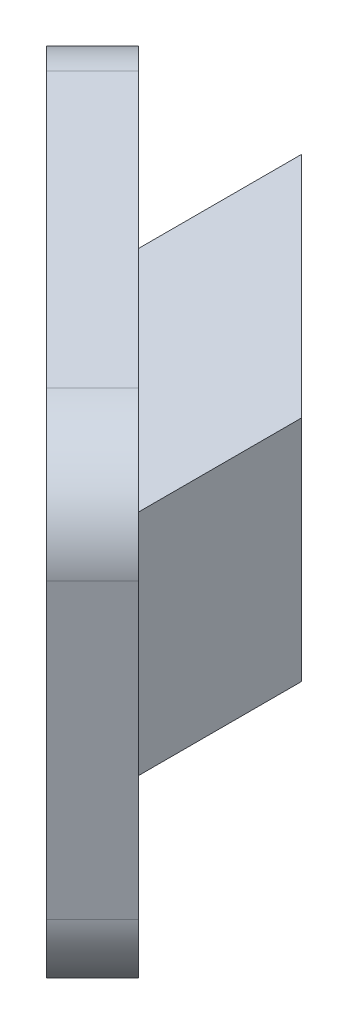
ISO-10303-21;
HEADER;
FILE_DESCRIPTION(('STEP AP214'),'2;1');
FILE_NAME('part.step','',(''),(''),'','','');
FILE_SCHEMA(('AUTOMOTIVE_DESIGN { 1 0 10303 214 1 1 1 1 }'));
ENDSEC;
DATA;
#1=APPLICATION_CONTEXT('core data for automotive mechanical design processes');
#2=APPLICATION_PROTOCOL_DEFINITION('international standard','automotive_design',2000,#1);
#3=PRODUCT_CONTEXT('',#1,'mechanical');
#4=PRODUCT('Part','Part','',(#3));
#5=PRODUCT_RELATED_PRODUCT_CATEGORY('part','',(#4));
#6=PRODUCT_DEFINITION_FORMATION('','',#4);
#7=PRODUCT_DEFINITION_CONTEXT('part definition',#1,'design');
#8=PRODUCT_DEFINITION('design','',#6,#7);
#9=PRODUCT_DEFINITION_SHAPE('','',#8);
#10=(LENGTH_UNIT() NAMED_UNIT(*) SI_UNIT(.MILLI.,.METRE.));
#11=(NAMED_UNIT(*) PLANE_ANGLE_UNIT() SI_UNIT($,.RADIAN.));
#12=(NAMED_UNIT(*) SI_UNIT($,.STERADIAN.) SOLID_ANGLE_UNIT());
#13=UNCERTAINTY_MEASURE_WITH_UNIT(LENGTH_MEASURE(1.E-05),#10,'distance_accuracy_value','');
#14=(GEOMETRIC_REPRESENTATION_CONTEXT(3) GLOBAL_UNCERTAINTY_ASSIGNED_CONTEXT((#13)) GLOBAL_UNIT_ASSIGNED_CONTEXT((#10,
#11,#12)) REPRESENTATION_CONTEXT('',''));
#15=CARTESIAN_POINT('',(0.,0.,0.));
#16=DIRECTION('',(0.,0.,1.));
#17=DIRECTION('',(1.,0.,0.));
#18=AXIS2_PLACEMENT_3D('',#15,#16,#17);
#19=CARTESIAN_POINT('',(3.5,3.5,12.));
#20=DIRECTION('',(-1.,0.,0.));
#21=DIRECTION('',(0.,-1.,0.));
#22=AXIS2_PLACEMENT_3D('',#19,#20,#21);
#23=PLANE('',#22);
#24=DIRECTION('',(0.,0.,-1.));
#25=VECTOR('',#24,1.);
#26=CARTESIAN_POINT('',(3.5,-3.5,12.));
#27=LINE('',#26,#25);
#28=CARTESIAN_POINT('',(3.5,-3.5,12.));
#29=VERTEX_POINT('',#28);
#30=CARTESIAN_POINT('',(3.5,-3.5,7.));
#31=VERTEX_POINT('',#30);
#32=EDGE_CURVE('E164',#29,#31,#27,.T.);
#33=ORIENTED_EDGE('',*,*,#32,.T.);
#34=DIRECTION('',(0.,1.,0.));
#35=VECTOR('',#34,1.);
#36=CARTESIAN_POINT('',(3.5,-7.5,7.));
#37=LINE('',#36,#35);
#38=CARTESIAN_POINT('',(3.5,3.5,7.));
#39=VERTEX_POINT('',#38);
#40=EDGE_CURVE('E153',#31,#39,#37,.T.);
#41=ORIENTED_EDGE('',*,*,#40,.T.);
#42=DIRECTION('',(0.,0.,-1.));
#43=VECTOR('',#42,1.);
#44=CARTESIAN_POINT('',(3.5,3.5,12.));
#45=LINE('',#44,#43);
#46=CARTESIAN_POINT('',(3.5,3.5,12.));
#47=VERTEX_POINT('',#46);
#48=EDGE_CURVE('E151',#47,#39,#45,.T.);
#49=ORIENTED_EDGE('',*,*,#48,.F.);
#50=DIRECTION('',(0.,1.,0.));
#51=VECTOR('',#50,1.);
#52=CARTESIAN_POINT('',(3.5,3.5,12.));
#53=LINE('',#52,#51);
#54=EDGE_CURVE('E141',#29,#47,#53,.T.);
#55=ORIENTED_EDGE('',*,*,#54,.F.);
#56=EDGE_LOOP('',(#33,#41,#49,#55));
#57=FACE_BOUND('',#56,.T.);
#58=ADVANCED_FACE('F39',(#57),#23,.F.);
#59=CARTESIAN_POINT('',(-3.5,3.5,12.));
#60=DIRECTION('',(0.,-1.,0.));
#61=DIRECTION('',(1.,0.,0.));
#62=AXIS2_PLACEMENT_3D('',#59,#60,#61);
#63=PLANE('',#62);
#64=ORIENTED_EDGE('',*,*,#48,.T.);
#65=DIRECTION('',(0.707106781186548,0.,0.707106781186547));
#66=VECTOR('',#65,1.);
#67=CARTESIAN_POINT('',(-3.5,3.5,0.));
#68=LINE('',#67,#66);
#69=CARTESIAN_POINT('',(-3.5,3.5,0.));
#70=VERTEX_POINT('',#69);
#71=EDGE_CURVE('E132',#70,#39,#68,.T.);
#72=ORIENTED_EDGE('',*,*,#71,.F.);
#73=DIRECTION('',(0.,0.,-1.));
#74=VECTOR('',#73,1.);
#75=CARTESIAN_POINT('',(-3.5,3.5,12.));
#76=LINE('',#75,#74);
#77=CARTESIAN_POINT('',(-3.5,3.5,5.00000000000008));
#78=VERTEX_POINT('',#77);
#79=EDGE_CURVE('E149',#78,#70,#76,.T.);
#80=ORIENTED_EDGE('',*,*,#79,.F.);
#81=DIRECTION('',(-0.707106781186551,0.,-0.707106781186544));
#82=VECTOR('',#81,1.);
#83=CARTESIAN_POINT('',(3.5,3.5,12.));
#84=LINE('',#83,#82);
#85=EDGE_CURVE('E254',#47,#78,#84,.T.);
#86=ORIENTED_EDGE('',*,*,#85,.F.);
#87=EDGE_LOOP('',(#64,#72,#80,#86));
#88=FACE_BOUND('',#87,.T.);
#89=ADVANCED_FACE('F147',(#88),#63,.F.);
#90=CARTESIAN_POINT('',(-3.5,3.5,12.));
#91=DIRECTION('',(1.,0.,0.));
#92=DIRECTION('',(0.,1.,0.));
#93=AXIS2_PLACEMENT_3D('',#90,#91,#92);
#94=PLANE('',#93);
#95=DIRECTION('',(0.,0.,-1.));
#96=VECTOR('',#95,1.);
#97=CARTESIAN_POINT('',(-3.5,-3.5,12.));
#98=LINE('',#97,#96);
#99=CARTESIAN_POINT('',(-3.5,-3.5,5.00000000000008));
#100=VERTEX_POINT('',#99);
#101=CARTESIAN_POINT('',(-3.5,-3.5,0.));
#102=VERTEX_POINT('',#101);
#103=EDGE_CURVE('E158',#100,#102,#98,.T.);
#104=ORIENTED_EDGE('',*,*,#103,.F.);
#105=DIRECTION('',(0.,1.,0.));
#106=VECTOR('',#105,1.);
#107=CARTESIAN_POINT('',(-3.5,-3.5,5.00000000000008));
#108=LINE('',#107,#106);
#109=EDGE_CURVE('E142',#100,#78,#108,.T.);
#110=ORIENTED_EDGE('',*,*,#109,.T.);
#111=ORIENTED_EDGE('',*,*,#79,.T.);
#112=DIRECTION('',(0.,-1.,0.));
#113=VECTOR('',#112,1.);
#114=CARTESIAN_POINT('',(-3.5,3.5,0.));
#115=LINE('',#114,#113);
#116=EDGE_CURVE('E129',#70,#102,#115,.T.);
#117=ORIENTED_EDGE('',*,*,#116,.T.);
#118=EDGE_LOOP('',(#104,#110,#111,#117));
#119=FACE_BOUND('',#118,.T.);
#120=ADVANCED_FACE('F156',(#119),#94,.F.);
#121=CARTESIAN_POINT('',(-3.5,-3.5,12.));
#122=DIRECTION('',(0.,1.,0.));
#123=DIRECTION('',(-1.,0.,0.));
#124=AXIS2_PLACEMENT_3D('',#121,#122,#123);
#125=PLANE('',#124);
#126=ORIENTED_EDGE('',*,*,#103,.T.);
#127=DIRECTION('',(0.707106781186548,0.,0.707106781186547));
#128=VECTOR('',#127,1.);
#129=CARTESIAN_POINT('',(2.5,-3.5,6.));
#130=LINE('',#129,#128);
#131=EDGE_CURVE('E135',#102,#31,#130,.T.);
#132=ORIENTED_EDGE('',*,*,#131,.T.);
#133=ORIENTED_EDGE('',*,*,#32,.F.);
#134=DIRECTION('',(-0.707106781186551,0.,-0.707106781186544));
#135=VECTOR('',#134,1.);
#136=CARTESIAN_POINT('',(3.5,-3.5,12.));
#137=LINE('',#136,#135);
#138=EDGE_CURVE('E250',#29,#100,#137,.T.);
#139=ORIENTED_EDGE('',*,*,#138,.T.);
#140=EDGE_LOOP('',(#126,#132,#133,#139));
#141=FACE_BOUND('',#140,.T.);
#142=ADVANCED_FACE('F267',(#141),#125,.F.);
#143=CARTESIAN_POINT('',(0.,0.,12.));
#144=DIRECTION('',(0.,0.,-1.));
#145=DIRECTION('',(-1.,0.,0.));
#146=AXIS2_PLACEMENT_3D('',#143,#144,#145);
#147=CYLINDRICAL_SURFACE('',#146,3.);
#148=CARTESIAN_POINT('',(0.,0.,3.5));
#149=DIRECTION('',(-0.707106781186547,0.,0.707106781186548));
#150=DIRECTION('',(-0.707106781186548,0.,-0.707106781186547));
#151=AXIS2_PLACEMENT_3D('',#148,#149,#150);
#152=ELLIPSE('',#151,4.24264068711928,3.);
#153=CARTESIAN_POINT('',(-3.,0.,0.500000000000001));
#154=VERTEX_POINT('',#153);
#155=EDGE_CURVE('E173',#154,#154,#152,.T.);
#156=ORIENTED_EDGE('',*,*,#155,.F.);
#157=EDGE_LOOP('',(#156));
#158=FACE_BOUND('',#157,.T.);
#159=CARTESIAN_POINT('',(0.,0.,11.3284271247462));
#160=DIRECTION('',(-0.707106781186544,0.,0.707106781186551));
#161=DIRECTION('',(-0.707106781186551,0.,-0.707106781186544));
#162=AXIS2_PLACEMENT_3D('',#159,#160,#161);
#163=ELLIPSE('',#162,4.24264068711926,3.);
#164=CARTESIAN_POINT('',(-3.,0.,8.32842712474625));
#165=VERTEX_POINT('',#164);
#166=EDGE_CURVE('E168',#165,#165,#163,.T.);
#167=ORIENTED_EDGE('',*,*,#166,.T.);
#168=EDGE_LOOP('',(#167));
#169=FACE_BOUND('',#168,.T.);
#170=ADVANCED_FACE('F352',(#158,#169),#147,.F.);
#171=CARTESIAN_POINT('',(4.91421356237312,-7.5,16.2426406871193));
#172=DIRECTION('',(-0.707106781186551,0.,-0.707106781186544));
#173=DIRECTION('',(-0.707106781186544,0.,0.707106781186551));
#174=AXIS2_PLACEMENT_3D('',#171,#172,#173);
#175=PLANE('',#174);
#176=DIRECTION('',(0.,1.,0.));
#177=VECTOR('',#176,1.);
#178=CARTESIAN_POINT('',(4.91421356237312,-7.5,16.2426406871193));
#179=LINE('',#178,#177);
#180=CARTESIAN_POINT('',(4.91421356237312,-4.5,16.2426406871193));
#181=VERTEX_POINT('',#180);
#182=CARTESIAN_POINT('',(4.91421356237312,4.5,16.2426406871193));
#183=VERTEX_POINT('',#182);
#184=EDGE_CURVE('E249',#181,#183,#179,.T.);
#185=ORIENTED_EDGE('',*,*,#184,.F.);
#186=DIRECTION('',(0.707106781186544,0.,-0.707106781186551));
#187=VECTOR('',#186,1.);
#188=CARTESIAN_POINT('',(4.91421356237312,-4.5,16.2426406871193));
#189=LINE('',#188,#187);
#190=CARTESIAN_POINT('',(6.32842712474621,-4.5,14.8284271247462));
#191=VERTEX_POINT('',#190);
#192=EDGE_CURVE('E179',#181,#191,#189,.T.);
#193=ORIENTED_EDGE('',*,*,#192,.T.);
#194=DIRECTION('',(0.,1.,0.));
#195=VECTOR('',#194,1.);
#196=CARTESIAN_POINT('',(6.32842712474621,-7.5,14.8284271247462));
#197=LINE('',#196,#195);
#198=CARTESIAN_POINT('',(6.32842712474621,4.5,14.8284271247462));
#199=VERTEX_POINT('',#198);
#200=EDGE_CURVE('E172',#191,#199,#197,.T.);
#201=ORIENTED_EDGE('',*,*,#200,.T.);
#202=DIRECTION('',(0.707106781186544,0.,-0.707106781186551));
#203=VECTOR('',#202,1.);
#204=CARTESIAN_POINT('',(4.91421356237312,4.5,16.2426406871193));
#205=LINE('',#204,#203);
#206=EDGE_CURVE('E162',#199,#183,#205,.F.);
#207=ORIENTED_EDGE('',*,*,#206,.T.);
#208=EDGE_LOOP('',(#185,#193,#201,#207));
#209=FACE_BOUND('',#208,.T.);
#210=ADVANCED_FACE('F293',(#209),#175,.F.);
#211=CARTESIAN_POINT('',(4.91421356237312,7.5,16.2426406871193));
#212=DIRECTION('',(0.,-1.,0.));
#213=DIRECTION('',(0.,0.,-1.));
#214=AXIS2_PLACEMENT_3D('',#211,#212,#213);
#215=PLANE('',#214);
#216=DIRECTION('',(-0.707106781186551,0.,-0.707106781186544));
#217=VECTOR('',#216,1.);
#218=CARTESIAN_POINT('',(6.32842712474621,7.5,14.8284271247462));
#219=LINE('',#218,#217);
#220=CARTESIAN_POINT('',(4.20710678118655,7.5,12.7071067811865));
#221=VERTEX_POINT('',#220);
#222=CARTESIAN_POINT('',(-4.20710678118655,7.5,4.29289321881353));
#223=VERTEX_POINT('',#222);
#224=EDGE_CURVE('E226',#221,#223,#219,.T.);
#225=ORIENTED_EDGE('',*,*,#224,.T.);
#226=DIRECTION('',(0.707106781186544,0.,-0.707106781186551));
#227=VECTOR('',#226,1.);
#228=CARTESIAN_POINT('',(-5.62132034355964,7.5,5.70710678118664));
#229=LINE('',#228,#227);
#230=CARTESIAN_POINT('',(-5.62132034355964,7.5,5.70710678118663));
#231=VERTEX_POINT('',#230);
#232=EDGE_CURVE('E11',#223,#231,#229,.F.);
#233=ORIENTED_EDGE('',*,*,#232,.T.);
#234=DIRECTION('',(-0.707106781186551,0.,-0.707106781186544));
#235=VECTOR('',#234,1.);
#236=CARTESIAN_POINT('',(4.91421356237312,7.5,16.2426406871193));
#237=LINE('',#236,#235);
#238=CARTESIAN_POINT('',(2.79289321881346,7.5,14.1213203435596));
#239=VERTEX_POINT('',#238);
#240=EDGE_CURVE('E228',#239,#231,#237,.T.);
#241=ORIENTED_EDGE('',*,*,#240,.F.);
#242=DIRECTION('',(0.707106781186544,0.,-0.707106781186551));
#243=VECTOR('',#242,1.);
#244=CARTESIAN_POINT('',(2.79289321881346,7.5,14.1213203435596));
#245=LINE('',#244,#243);
#246=EDGE_CURVE('E48',#239,#221,#245,.T.);
#247=ORIENTED_EDGE('',*,*,#246,.T.);
#248=EDGE_LOOP('',(#225,#233,#241,#247));
#249=FACE_BOUND('',#248,.T.);
#250=ADVANCED_FACE('F225',(#249),#215,.F.);
#251=CARTESIAN_POINT('',(-7.74264068711929,7.5,3.585786437627));
#252=DIRECTION('',(0.707106781186551,0.,0.707106781186544));
#253=DIRECTION('',(0.707106781186544,0.,-0.707106781186551));
#254=AXIS2_PLACEMENT_3D('',#251,#252,#253);
#255=PLANE('',#254);
#256=DIRECTION('',(0.,-1.,0.));
#257=VECTOR('',#256,1.);
#258=CARTESIAN_POINT('',(-6.32842712474621,7.5,2.1715728752539));
#259=LINE('',#258,#257);
#260=CARTESIAN_POINT('',(-6.3284271247462,4.5,2.1715728752539));
#261=VERTEX_POINT('',#260);
#262=CARTESIAN_POINT('',(-6.3284271247462,-4.5,2.17157287525391));
#263=VERTEX_POINT('',#262);
#264=EDGE_CURVE('E237',#261,#263,#259,.T.);
#265=ORIENTED_EDGE('',*,*,#264,.T.);
#266=DIRECTION('',(0.707106781186544,0.,-0.707106781186551));
#267=VECTOR('',#266,1.);
#268=CARTESIAN_POINT('',(-7.74264068711929,-4.5,3.58578643762701));
#269=LINE('',#268,#267);
#270=CARTESIAN_POINT('',(-7.74264068711929,-4.5,3.58578643762701));
#271=VERTEX_POINT('',#270);
#272=EDGE_CURVE('E55',#263,#271,#269,.F.);
#273=ORIENTED_EDGE('',*,*,#272,.T.);
#274=DIRECTION('',(0.,-1.,0.));
#275=VECTOR('',#274,1.);
#276=CARTESIAN_POINT('',(-7.74264068711929,7.5,3.585786437627));
#277=LINE('',#276,#275);
#278=CARTESIAN_POINT('',(-7.74264068711929,4.5,3.585786437627));
#279=VERTEX_POINT('',#278);
#280=EDGE_CURVE('E277',#279,#271,#277,.T.);
#281=ORIENTED_EDGE('',*,*,#280,.F.);
#282=DIRECTION('',(0.707106781186544,0.,-0.707106781186551));
#283=VECTOR('',#282,1.);
#284=CARTESIAN_POINT('',(-7.74264068711929,4.5,3.585786437627));
#285=LINE('',#284,#283);
#286=EDGE_CURVE('E213',#279,#261,#285,.T.);
#287=ORIENTED_EDGE('',*,*,#286,.T.);
#288=EDGE_LOOP('',(#265,#273,#281,#287));
#289=FACE_BOUND('',#288,.T.);
#290=ADVANCED_FACE('F299',(#289),#255,.F.);
#291=CARTESIAN_POINT('',(-7.74264068711929,-7.5,3.58578643762701));
#292=DIRECTION('',(0.,1.,0.));
#293=DIRECTION('',(-1.,0.,0.));
#294=AXIS2_PLACEMENT_3D('',#291,#292,#293);
#295=PLANE('',#294);
#296=DIRECTION('',(0.707106781186551,0.,0.707106781186544));
#297=VECTOR('',#296,1.);
#298=CARTESIAN_POINT('',(-6.3284271247462,-7.5,2.17157287525391));
#299=LINE('',#298,#297);
#300=CARTESIAN_POINT('',(-4.20710678118655,-7.5,4.29289321881354));
#301=VERTEX_POINT('',#300);
#302=CARTESIAN_POINT('',(4.20710678118655,-7.5,12.7071067811865));
#303=VERTEX_POINT('',#302);
#304=EDGE_CURVE('E241',#301,#303,#299,.T.);
#305=ORIENTED_EDGE('',*,*,#304,.T.);
#306=DIRECTION('',(0.707106781186544,0.,-0.707106781186551));
#307=VECTOR('',#306,1.);
#308=CARTESIAN_POINT('',(2.79289321881347,-7.5,14.1213203435596));
#309=LINE('',#308,#307);
#310=CARTESIAN_POINT('',(2.79289321881346,-7.5,14.1213203435596));
#311=VERTEX_POINT('',#310);
#312=EDGE_CURVE('E199',#303,#311,#309,.F.);
#313=ORIENTED_EDGE('',*,*,#312,.T.);
#314=DIRECTION('',(0.707106781186551,0.,0.707106781186544));
#315=VECTOR('',#314,1.);
#316=CARTESIAN_POINT('',(-7.74264068711929,-7.5,3.58578643762701));
#317=LINE('',#316,#315);
#318=CARTESIAN_POINT('',(-5.62132034355964,-7.5,5.70710678118664));
#319=VERTEX_POINT('',#318);
#320=EDGE_CURVE('E257',#319,#311,#317,.T.);
#321=ORIENTED_EDGE('',*,*,#320,.F.);
#322=DIRECTION('',(0.707106781186544,0.,-0.707106781186551));
#323=VECTOR('',#322,1.);
#324=CARTESIAN_POINT('',(-5.62132034355964,-7.5,5.70710678118664));
#325=LINE('',#324,#323);
#326=EDGE_CURVE('E195',#319,#301,#325,.T.);
#327=ORIENTED_EDGE('',*,*,#326,.T.);
#328=EDGE_LOOP('',(#305,#313,#321,#327));
#329=FACE_BOUND('',#328,.T.);
#330=ADVANCED_FACE('F296',(#329),#295,.F.);
#331=CARTESIAN_POINT('',(-5.66421356237311,0.,5.66421356237317));
#332=DIRECTION('',(-0.707106781186544,0.,0.707106781186551));
#333=DIRECTION('',(0.707106781186551,0.,0.707106781186544));
#334=AXIS2_PLACEMENT_3D('',#331,#332,#333);
#335=PLANE('',#334);
#336=ORIENTED_EDGE('',*,*,#166,.F.);
#337=EDGE_LOOP('',(#336));
#338=FACE_BOUND('',#337,.T.);
#339=ORIENTED_EDGE('',*,*,#320,.T.);
#340=CARTESIAN_POINT('',(2.79289321881346,-4.5,14.1213203435596));
#341=DIRECTION('',(-0.707106781186544,0.,0.707106781186551));
#342=DIRECTION('',(0.707106781186551,0.,0.707106781186544));
#343=AXIS2_PLACEMENT_3D('',#340,#341,#342);
#344=CIRCLE('',#343,3.);
#345=EDGE_CURVE('E210',#311,#181,#344,.T.);
#346=ORIENTED_EDGE('',*,*,#345,.T.);
#347=ORIENTED_EDGE('',*,*,#184,.T.);
#348=CARTESIAN_POINT('',(2.79289321881346,4.5,14.1213203435596));
#349=DIRECTION('',(-0.707106781186544,0.,0.707106781186551));
#350=DIRECTION('',(0.707106781186551,0.,0.707106781186544));
#351=AXIS2_PLACEMENT_3D('',#348,#349,#350);
#352=CIRCLE('',#351,3.);
#353=EDGE_CURVE('E202',#183,#239,#352,.T.);
#354=ORIENTED_EDGE('',*,*,#353,.T.);
#355=ORIENTED_EDGE('',*,*,#240,.T.);
#356=CARTESIAN_POINT('',(-5.62132034355964,4.5,5.70710678118664));
#357=DIRECTION('',(-0.707106781186544,0.,0.707106781186551));
#358=DIRECTION('',(0.707106781186551,0.,0.707106781186544));
#359=AXIS2_PLACEMENT_3D('',#356,#357,#358);
#360=CIRCLE('',#359,3.);
#361=EDGE_CURVE('E62',#231,#279,#360,.T.);
#362=ORIENTED_EDGE('',*,*,#361,.T.);
#363=ORIENTED_EDGE('',*,*,#280,.T.);
#364=CARTESIAN_POINT('',(-5.62132034355964,-4.5,5.70710678118664));
#365=DIRECTION('',(-0.707106781186544,0.,0.707106781186551));
#366=DIRECTION('',(0.707106781186551,0.,0.707106781186544));
#367=AXIS2_PLACEMENT_3D('',#364,#365,#366);
#368=CIRCLE('',#367,3.);
#369=EDGE_CURVE('E207',#271,#319,#368,.T.);
#370=ORIENTED_EDGE('',*,*,#369,.T.);
#371=EDGE_LOOP('',(#339,#346,#347,#354,#355,#362,#363,#370));
#372=FACE_BOUND('',#371,.T.);
#373=ADVANCED_FACE('F283',(#338,#372),#335,.T.);
#374=CARTESIAN_POINT('',(-4.25000000000002,0.,4.25000000000007));
#375=DIRECTION('',(-0.707106781186544,0.,0.707106781186551));
#376=DIRECTION('',(0.707106781186551,0.,0.707106781186544));
#377=AXIS2_PLACEMENT_3D('',#374,#375,#376);
#378=PLANE('',#377);
#379=ORIENTED_EDGE('',*,*,#138,.F.);
#380=ORIENTED_EDGE('',*,*,#54,.T.);
#381=ORIENTED_EDGE('',*,*,#85,.T.);
#382=ORIENTED_EDGE('',*,*,#109,.F.);
#383=EDGE_LOOP('',(#379,#380,#381,#382));
#384=FACE_BOUND('',#383,.T.);
#385=ORIENTED_EDGE('',*,*,#200,.F.);
#386=CARTESIAN_POINT('',(4.20710678118655,-4.5,12.7071067811865));
#387=DIRECTION('',(-0.707106781186544,0.,0.707106781186551));
#388=DIRECTION('',(0.707106781186551,0.,0.707106781186544));
#389=AXIS2_PLACEMENT_3D('',#386,#387,#388);
#390=CIRCLE('',#389,3.);
#391=EDGE_CURVE('E192',#191,#303,#390,.F.);
#392=ORIENTED_EDGE('',*,*,#391,.T.);
#393=ORIENTED_EDGE('',*,*,#304,.F.);
#394=CARTESIAN_POINT('',(-4.20710678118655,-4.5,4.29289321881354));
#395=DIRECTION('',(-0.707106781186544,0.,0.707106781186551));
#396=DIRECTION('',(0.707106781186551,0.,0.707106781186544));
#397=AXIS2_PLACEMENT_3D('',#394,#395,#396);
#398=CIRCLE('',#397,3.);
#399=EDGE_CURVE('E189',#301,#263,#398,.F.);
#400=ORIENTED_EDGE('',*,*,#399,.T.);
#401=ORIENTED_EDGE('',*,*,#264,.F.);
#402=CARTESIAN_POINT('',(-4.20710678118655,4.5,4.29289321881353));
#403=DIRECTION('',(-0.707106781186544,0.,0.707106781186551));
#404=DIRECTION('',(0.707106781186551,0.,0.707106781186544));
#405=AXIS2_PLACEMENT_3D('',#402,#403,#404);
#406=CIRCLE('',#405,3.);
#407=EDGE_CURVE('E186',#261,#223,#406,.F.);
#408=ORIENTED_EDGE('',*,*,#407,.T.);
#409=ORIENTED_EDGE('',*,*,#224,.F.);
#410=CARTESIAN_POINT('',(4.20710678118655,4.5,12.7071067811865));
#411=DIRECTION('',(-0.707106781186544,0.,0.707106781186551));
#412=DIRECTION('',(0.707106781186551,0.,0.707106781186544));
#413=AXIS2_PLACEMENT_3D('',#410,#411,#412);
#414=CIRCLE('',#413,3.);
#415=EDGE_CURVE('E183',#221,#199,#414,.F.);
#416=ORIENTED_EDGE('',*,*,#415,.T.);
#417=EDGE_LOOP('',(#385,#392,#393,#400,#401,#408,#409,#416));
#418=FACE_BOUND('',#417,.T.);
#419=ADVANCED_FACE('F233',(#384,#418),#378,.F.);
#420=CARTESIAN_POINT('',(-3.5,-7.5,0.));
#421=DIRECTION('',(-0.707106781186547,0.,0.707106781186548));
#422=DIRECTION('',(0.707106781186548,0.,0.707106781186547));
#423=AXIS2_PLACEMENT_3D('',#420,#421,#422);
#424=PLANE('',#423);
#425=ORIENTED_EDGE('',*,*,#155,.T.);
#426=EDGE_LOOP('',(#425));
#427=FACE_BOUND('',#426,.T.);
#428=ORIENTED_EDGE('',*,*,#116,.F.);
#429=ORIENTED_EDGE('',*,*,#71,.T.);
#430=ORIENTED_EDGE('',*,*,#40,.F.);
#431=ORIENTED_EDGE('',*,*,#131,.F.);
#432=EDGE_LOOP('',(#428,#429,#430,#431));
#433=FACE_BOUND('',#432,.T.);
#434=ADVANCED_FACE('F131',(#427,#433),#424,.F.);
#435=CARTESIAN_POINT('',(2.79289321881346,-4.5,14.1213203435596));
#436=DIRECTION('',(0.707106781186544,0.,-0.707106781186551));
#437=DIRECTION('',(-0.707106781186551,0.,-0.707106781186544));
#438=AXIS2_PLACEMENT_3D('',#435,#436,#437);
#439=CYLINDRICAL_SURFACE('',#438,3.);
#440=ORIENTED_EDGE('',*,*,#345,.F.);
#441=ORIENTED_EDGE('',*,*,#312,.F.);
#442=ORIENTED_EDGE('',*,*,#391,.F.);
#443=ORIENTED_EDGE('',*,*,#192,.F.);
#444=EDGE_LOOP('',(#440,#441,#442,#443));
#445=FACE_BOUND('',#444,.T.);
#446=ADVANCED_FACE('F291',(#445),#439,.T.);
#447=CARTESIAN_POINT('',(-5.62132034355964,-4.5,5.70710678118664));
#448=DIRECTION('',(0.707106781186544,0.,-0.707106781186551));
#449=DIRECTION('',(-0.707106781186551,0.,-0.707106781186544));
#450=AXIS2_PLACEMENT_3D('',#447,#448,#449);
#451=CYLINDRICAL_SURFACE('',#450,3.);
#452=ORIENTED_EDGE('',*,*,#369,.F.);
#453=ORIENTED_EDGE('',*,*,#272,.F.);
#454=ORIENTED_EDGE('',*,*,#399,.F.);
#455=ORIENTED_EDGE('',*,*,#326,.F.);
#456=EDGE_LOOP('',(#452,#453,#454,#455));
#457=FACE_BOUND('',#456,.T.);
#458=ADVANCED_FACE('F298',(#457),#451,.T.);
#459=CARTESIAN_POINT('',(-5.62132034355964,4.5,5.70710678118663));
#460=DIRECTION('',(0.707106781186544,0.,-0.707106781186551));
#461=DIRECTION('',(-0.707106781186551,0.,-0.707106781186544));
#462=AXIS2_PLACEMENT_3D('',#459,#460,#461);
#463=CYLINDRICAL_SURFACE('',#462,3.);
#464=ORIENTED_EDGE('',*,*,#361,.F.);
#465=ORIENTED_EDGE('',*,*,#232,.F.);
#466=ORIENTED_EDGE('',*,*,#407,.F.);
#467=ORIENTED_EDGE('',*,*,#286,.F.);
#468=EDGE_LOOP('',(#464,#465,#466,#467));
#469=FACE_BOUND('',#468,.T.);
#470=ADVANCED_FACE('F302',(#469),#463,.T.);
#471=CARTESIAN_POINT('',(2.79289321881346,4.5,14.1213203435596));
#472=DIRECTION('',(0.707106781186544,0.,-0.707106781186551));
#473=DIRECTION('',(-0.707106781186551,0.,-0.707106781186544));
#474=AXIS2_PLACEMENT_3D('',#471,#472,#473);
#475=CYLINDRICAL_SURFACE('',#474,3.);
#476=ORIENTED_EDGE('',*,*,#353,.F.);
#477=ORIENTED_EDGE('',*,*,#206,.F.);
#478=ORIENTED_EDGE('',*,*,#415,.F.);
#479=ORIENTED_EDGE('',*,*,#246,.F.);
#480=EDGE_LOOP('',(#476,#477,#478,#479));
#481=FACE_BOUND('',#480,.T.);
#482=ADVANCED_FACE('F41',(#481),#475,.T.);
#483=CLOSED_SHELL('',(#58,#89,#120,#142,#170,#210,#250,#290,#330,#373,#419,#434,#446,#458,#470,#482));
#484=MANIFOLD_SOLID_BREP('B2',#483);
#485=ADVANCED_BREP_SHAPE_REPRESENTATION('',(#18,#484),#14);
#486=SHAPE_DEFINITION_REPRESENTATION(#9,#485);
ENDSEC;
END-ISO-10303-21;
